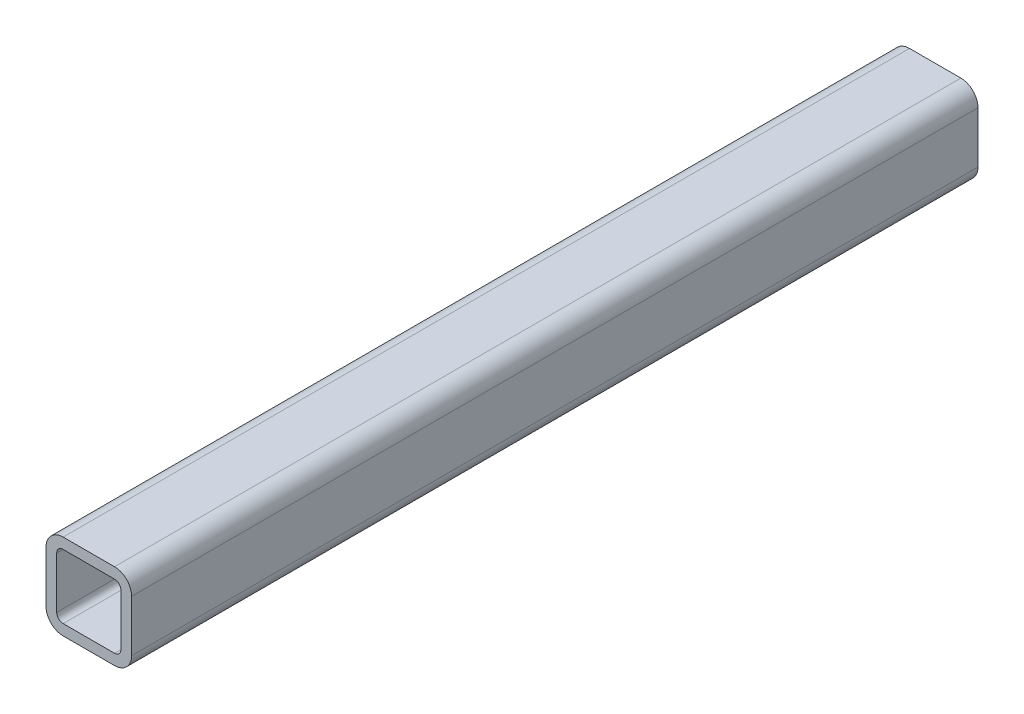
ISO-10303-21;
HEADER;
FILE_DESCRIPTION(('STEP AP214'),'2;1');
FILE_NAME('part.step','',(''),(''),'','','');
FILE_SCHEMA(('AUTOMOTIVE_DESIGN { 1 0 10303 214 1 1 1 1 }'));
ENDSEC;
DATA;
#1=APPLICATION_CONTEXT('core data for automotive mechanical design processes');
#2=APPLICATION_PROTOCOL_DEFINITION('international standard','automotive_design',2000,#1);
#3=PRODUCT_CONTEXT('',#1,'mechanical');
#4=PRODUCT('Part','Part','',(#3));
#5=PRODUCT_RELATED_PRODUCT_CATEGORY('part','',(#4));
#6=PRODUCT_DEFINITION_FORMATION('','',#4);
#7=PRODUCT_DEFINITION_CONTEXT('part definition',#1,'design');
#8=PRODUCT_DEFINITION('design','',#6,#7);
#9=PRODUCT_DEFINITION_SHAPE('','',#8);
#10=(LENGTH_UNIT() NAMED_UNIT(*) SI_UNIT(.MILLI.,.METRE.));
#11=(NAMED_UNIT(*) PLANE_ANGLE_UNIT() SI_UNIT($,.RADIAN.));
#12=(NAMED_UNIT(*) SI_UNIT($,.STERADIAN.) SOLID_ANGLE_UNIT());
#13=UNCERTAINTY_MEASURE_WITH_UNIT(LENGTH_MEASURE(1.E-05),#10,'distance_accuracy_value','');
#14=(GEOMETRIC_REPRESENTATION_CONTEXT(3) GLOBAL_UNCERTAINTY_ASSIGNED_CONTEXT((#13)) GLOBAL_UNIT_ASSIGNED_CONTEXT((#10,
#11,#12)) REPRESENTATION_CONTEXT('',''));
#15=CARTESIAN_POINT('',(0.,0.,0.));
#16=DIRECTION('',(0.,0.,1.));
#17=DIRECTION('',(1.,0.,0.));
#18=AXIS2_PLACEMENT_3D('',#15,#16,#17);
#19=CARTESIAN_POINT('',(7.62000000000002,7.61999999999996,-251.1044));
#20=DIRECTION('',(0.,0.,1.));
#21=DIRECTION('',(1.,0.,0.));
#22=AXIS2_PLACEMENT_3D('',#19,#20,#21);
#23=CYLINDRICAL_SURFACE('',#22,5.08);
#24=CARTESIAN_POINT('',(7.62000000000002,7.61999999999996,0.));
#25=DIRECTION('',(0.,0.,-1.));
#26=DIRECTION('',(-1.,0.,0.));
#27=AXIS2_PLACEMENT_3D('',#24,#25,#26);
#28=CIRCLE('',#27,5.08);
#29=CARTESIAN_POINT('',(7.62000000000002,12.7,0.));
#30=VERTEX_POINT('',#29);
#31=CARTESIAN_POINT('',(12.7,7.61999999999996,0.));
#32=VERTEX_POINT('',#31);
#33=EDGE_CURVE('E239',#30,#32,#28,.T.);
#34=ORIENTED_EDGE('',*,*,#33,.T.);
#35=DIRECTION('',(0.,0.,1.));
#36=VECTOR('',#35,1.);
#37=CARTESIAN_POINT('',(12.7,7.61999999999996,-251.1044));
#38=LINE('',#37,#36);
#39=CARTESIAN_POINT('',(12.7,7.61999999999996,-251.1044));
#40=VERTEX_POINT('',#39);
#41=EDGE_CURVE('E12',#40,#32,#38,.T.);
#42=ORIENTED_EDGE('',*,*,#41,.F.);
#43=CARTESIAN_POINT('',(7.62000000000002,7.61999999999996,-251.1044));
#44=DIRECTION('',(0.,0.,-1.));
#45=DIRECTION('',(-1.,0.,0.));
#46=AXIS2_PLACEMENT_3D('',#43,#44,#45);
#47=CIRCLE('',#46,5.08);
#48=CARTESIAN_POINT('',(7.62000000000002,12.7,-251.1044));
#49=VERTEX_POINT('',#48);
#50=EDGE_CURVE('E317',#49,#40,#47,.T.);
#51=ORIENTED_EDGE('',*,*,#50,.F.);
#52=DIRECTION('',(0.,0.,1.));
#53=VECTOR('',#52,1.);
#54=CARTESIAN_POINT('',(7.62000000000002,12.7,-251.1044));
#55=LINE('',#54,#53);
#56=EDGE_CURVE('E254',#49,#30,#55,.T.);
#57=ORIENTED_EDGE('',*,*,#56,.T.);
#58=EDGE_LOOP('',(#34,#42,#51,#57));
#59=FACE_BOUND('',#58,.T.);
#60=ADVANCED_FACE('F67',(#59),#23,.T.);
#61=CARTESIAN_POINT('',(12.7,7.61999999999996,-251.1044));
#62=DIRECTION('',(-1.,0.,0.));
#63=DIRECTION('',(0.,0.,1.));
#64=AXIS2_PLACEMENT_3D('',#61,#62,#63);
#65=PLANE('',#64);
#66=DIRECTION('',(0.,-1.,0.));
#67=VECTOR('',#66,1.);
#68=CARTESIAN_POINT('',(12.7,7.61999999999996,0.));
#69=LINE('',#68,#67);
#70=CARTESIAN_POINT('',(12.7,-7.61999999999996,0.));
#71=VERTEX_POINT('',#70);
#72=EDGE_CURVE('E242',#32,#71,#69,.T.);
#73=ORIENTED_EDGE('',*,*,#72,.T.);
#74=DIRECTION('',(0.,0.,1.));
#75=VECTOR('',#74,1.);
#76=CARTESIAN_POINT('',(12.7,-7.61999999999996,-251.1044));
#77=LINE('',#76,#75);
#78=CARTESIAN_POINT('',(12.7,-7.61999999999996,-251.1044));
#79=VERTEX_POINT('',#78);
#80=EDGE_CURVE('E77',#79,#71,#77,.T.);
#81=ORIENTED_EDGE('',*,*,#80,.F.);
#82=DIRECTION('',(0.,-1.,0.));
#83=VECTOR('',#82,1.);
#84=CARTESIAN_POINT('',(12.7,7.61999999999996,-251.1044));
#85=LINE('',#84,#83);
#86=EDGE_CURVE('E319',#40,#79,#85,.T.);
#87=ORIENTED_EDGE('',*,*,#86,.F.);
#88=ORIENTED_EDGE('',*,*,#41,.T.);
#89=EDGE_LOOP('',(#73,#81,#87,#88));
#90=FACE_BOUND('',#89,.T.);
#91=ADVANCED_FACE('F354',(#90),#65,.F.);
#92=CARTESIAN_POINT('',(7.62000000000002,-7.61999999999996,-251.1044));
#93=DIRECTION('',(0.,0.,1.));
#94=DIRECTION('',(1.,0.,0.));
#95=AXIS2_PLACEMENT_3D('',#92,#93,#94);
#96=CYLINDRICAL_SURFACE('',#95,5.08);
#97=CARTESIAN_POINT('',(7.62000000000002,-7.61999999999996,0.));
#98=DIRECTION('',(0.,0.,-1.));
#99=DIRECTION('',(-1.,0.,0.));
#100=AXIS2_PLACEMENT_3D('',#97,#98,#99);
#101=CIRCLE('',#100,5.08);
#102=CARTESIAN_POINT('',(7.62000000000002,-12.7,0.));
#103=VERTEX_POINT('',#102);
#104=EDGE_CURVE('E244',#71,#103,#101,.T.);
#105=ORIENTED_EDGE('',*,*,#104,.T.);
#106=DIRECTION('',(0.,0.,1.));
#107=VECTOR('',#106,1.);
#108=CARTESIAN_POINT('',(7.62000000000002,-12.7,-251.1044));
#109=LINE('',#108,#107);
#110=CARTESIAN_POINT('',(7.62000000000002,-12.7,-251.1044));
#111=VERTEX_POINT('',#110);
#112=EDGE_CURVE('E261',#111,#103,#109,.T.);
#113=ORIENTED_EDGE('',*,*,#112,.F.);
#114=CARTESIAN_POINT('',(7.62000000000002,-7.61999999999996,-251.1044));
#115=DIRECTION('',(0.,0.,-1.));
#116=DIRECTION('',(-1.,0.,0.));
#117=AXIS2_PLACEMENT_3D('',#114,#115,#116);
#118=CIRCLE('',#117,5.08);
#119=EDGE_CURVE('E321',#79,#111,#118,.T.);
#120=ORIENTED_EDGE('',*,*,#119,.F.);
#121=ORIENTED_EDGE('',*,*,#80,.T.);
#122=EDGE_LOOP('',(#105,#113,#120,#121));
#123=FACE_BOUND('',#122,.T.);
#124=ADVANCED_FACE('F359',(#123),#96,.T.);
#125=CARTESIAN_POINT('',(-7.62000000000002,-12.7,-251.1044));
#126=DIRECTION('',(0.,1.,0.));
#127=DIRECTION('',(0.,0.,1.));
#128=AXIS2_PLACEMENT_3D('',#125,#126,#127);
#129=PLANE('',#128);
#130=DIRECTION('',(-1.,0.,0.));
#131=VECTOR('',#130,1.);
#132=CARTESIAN_POINT('',(-7.62000000000002,-12.7,0.));
#133=LINE('',#132,#131);
#134=CARTESIAN_POINT('',(-7.62000000000002,-12.7,0.));
#135=VERTEX_POINT('',#134);
#136=EDGE_CURVE('E246',#103,#135,#133,.T.);
#137=ORIENTED_EDGE('',*,*,#136,.T.);
#138=DIRECTION('',(0.,0.,1.));
#139=VECTOR('',#138,1.);
#140=CARTESIAN_POINT('',(-7.62000000000002,-12.7,-251.1044));
#141=LINE('',#140,#139);
#142=CARTESIAN_POINT('',(-7.62000000000002,-12.7,-251.1044));
#143=VERTEX_POINT('',#142);
#144=EDGE_CURVE('E258',#143,#135,#141,.T.);
#145=ORIENTED_EDGE('',*,*,#144,.F.);
#146=DIRECTION('',(-1.,0.,0.));
#147=VECTOR('',#146,1.);
#148=CARTESIAN_POINT('',(-7.62000000000002,-12.7,-251.1044));
#149=LINE('',#148,#147);
#150=EDGE_CURVE('E323',#111,#143,#149,.T.);
#151=ORIENTED_EDGE('',*,*,#150,.F.);
#152=ORIENTED_EDGE('',*,*,#112,.T.);
#153=EDGE_LOOP('',(#137,#145,#151,#152));
#154=FACE_BOUND('',#153,.T.);
#155=ADVANCED_FACE('F329',(#154),#129,.F.);
#156=CARTESIAN_POINT('',(-7.62000000000002,-7.61999999999996,-251.1044));
#157=DIRECTION('',(0.,0.,1.));
#158=DIRECTION('',(1.,0.,0.));
#159=AXIS2_PLACEMENT_3D('',#156,#157,#158);
#160=CYLINDRICAL_SURFACE('',#159,5.08);
#161=CARTESIAN_POINT('',(-7.62000000000002,-7.61999999999996,0.));
#162=DIRECTION('',(0.,0.,-1.));
#163=DIRECTION('',(-1.,0.,0.));
#164=AXIS2_PLACEMENT_3D('',#161,#162,#163);
#165=CIRCLE('',#164,5.08);
#166=CARTESIAN_POINT('',(-12.7,-7.61999999999996,0.));
#167=VERTEX_POINT('',#166);
#168=EDGE_CURVE('E248',#135,#167,#165,.T.);
#169=ORIENTED_EDGE('',*,*,#168,.T.);
#170=DIRECTION('',(0.,0.,1.));
#171=VECTOR('',#170,1.);
#172=CARTESIAN_POINT('',(-12.7,-7.61999999999996,-251.1044));
#173=LINE('',#172,#171);
#174=CARTESIAN_POINT('',(-12.7,-7.61999999999996,-251.1044));
#175=VERTEX_POINT('',#174);
#176=EDGE_CURVE('E206',#175,#167,#173,.T.);
#177=ORIENTED_EDGE('',*,*,#176,.F.);
#178=CARTESIAN_POINT('',(-7.62000000000002,-7.61999999999996,-251.1044));
#179=DIRECTION('',(0.,0.,-1.));
#180=DIRECTION('',(-1.,0.,0.));
#181=AXIS2_PLACEMENT_3D('',#178,#179,#180);
#182=CIRCLE('',#181,5.08);
#183=EDGE_CURVE('E197',#143,#175,#182,.T.);
#184=ORIENTED_EDGE('',*,*,#183,.F.);
#185=ORIENTED_EDGE('',*,*,#144,.T.);
#186=EDGE_LOOP('',(#169,#177,#184,#185));
#187=FACE_BOUND('',#186,.T.);
#188=ADVANCED_FACE('F333',(#187),#160,.T.);
#189=CARTESIAN_POINT('',(-12.7,-7.61999999999996,-251.1044));
#190=DIRECTION('',(1.,0.,0.));
#191=DIRECTION('',(0.,0.,-1.));
#192=AXIS2_PLACEMENT_3D('',#189,#190,#191);
#193=PLANE('',#192);
#194=DIRECTION('',(0.,1.,0.));
#195=VECTOR('',#194,1.);
#196=CARTESIAN_POINT('',(-12.7,-7.61999999999996,0.));
#197=LINE('',#196,#195);
#198=CARTESIAN_POINT('',(-12.7,7.61999999999996,0.));
#199=VERTEX_POINT('',#198);
#200=EDGE_CURVE('E205',#167,#199,#197,.T.);
#201=ORIENTED_EDGE('',*,*,#200,.T.);
#202=DIRECTION('',(0.,0.,1.));
#203=VECTOR('',#202,1.);
#204=CARTESIAN_POINT('',(-12.7,7.61999999999996,-251.1044));
#205=LINE('',#204,#203);
#206=CARTESIAN_POINT('',(-12.7,7.61999999999996,-251.1044));
#207=VERTEX_POINT('',#206);
#208=EDGE_CURVE('E202',#207,#199,#205,.T.);
#209=ORIENTED_EDGE('',*,*,#208,.F.);
#210=DIRECTION('',(0.,1.,0.));
#211=VECTOR('',#210,1.);
#212=CARTESIAN_POINT('',(-12.7,-7.61999999999996,-251.1044));
#213=LINE('',#212,#211);
#214=EDGE_CURVE('E191',#175,#207,#213,.T.);
#215=ORIENTED_EDGE('',*,*,#214,.F.);
#216=ORIENTED_EDGE('',*,*,#176,.T.);
#217=EDGE_LOOP('',(#201,#209,#215,#216));
#218=FACE_BOUND('',#217,.T.);
#219=ADVANCED_FACE('F203',(#218),#193,.F.);
#220=CARTESIAN_POINT('',(-7.62000000000002,7.61999999999996,-251.1044));
#221=DIRECTION('',(0.,0.,1.));
#222=DIRECTION('',(1.,0.,0.));
#223=AXIS2_PLACEMENT_3D('',#220,#221,#222);
#224=CYLINDRICAL_SURFACE('',#223,5.08);
#225=CARTESIAN_POINT('',(-7.62000000000002,7.61999999999996,0.));
#226=DIRECTION('',(0.,0.,-1.));
#227=DIRECTION('',(-1.,0.,0.));
#228=AXIS2_PLACEMENT_3D('',#225,#226,#227);
#229=CIRCLE('',#228,5.08);
#230=CARTESIAN_POINT('',(-7.62000000000002,12.7,0.));
#231=VERTEX_POINT('',#230);
#232=EDGE_CURVE('E139',#199,#231,#229,.T.);
#233=ORIENTED_EDGE('',*,*,#232,.T.);
#234=DIRECTION('',(0.,0.,1.));
#235=VECTOR('',#234,1.);
#236=CARTESIAN_POINT('',(-7.62000000000002,12.7,-251.1044));
#237=LINE('',#236,#235);
#238=CARTESIAN_POINT('',(-7.62000000000002,12.7,-251.1044));
#239=VERTEX_POINT('',#238);
#240=EDGE_CURVE('E207',#239,#231,#237,.T.);
#241=ORIENTED_EDGE('',*,*,#240,.F.);
#242=CARTESIAN_POINT('',(-7.62000000000002,7.61999999999996,-251.1044));
#243=DIRECTION('',(0.,0.,-1.));
#244=DIRECTION('',(-1.,0.,0.));
#245=AXIS2_PLACEMENT_3D('',#242,#243,#244);
#246=CIRCLE('',#245,5.08);
#247=EDGE_CURVE('E195',#207,#239,#246,.T.);
#248=ORIENTED_EDGE('',*,*,#247,.F.);
#249=ORIENTED_EDGE('',*,*,#208,.T.);
#250=EDGE_LOOP('',(#233,#241,#248,#249));
#251=FACE_BOUND('',#250,.T.);
#252=ADVANCED_FACE('F209',(#251),#224,.T.);
#253=CARTESIAN_POINT('',(7.62000000000002,-7.61999999999996,-251.1044));
#254=DIRECTION('',(0.,0.,1.));
#255=DIRECTION('',(1.,0.,0.));
#256=AXIS2_PLACEMENT_3D('',#253,#254,#255);
#257=CYLINDRICAL_SURFACE('',#256,1.905);
#258=CARTESIAN_POINT('',(7.62000000000002,-7.61999999999996,0.));
#259=DIRECTION('',(0.,0.,-1.));
#260=DIRECTION('',(-1.,0.,0.));
#261=AXIS2_PLACEMENT_3D('',#258,#259,#260);
#262=CIRCLE('',#261,1.905);
#263=CARTESIAN_POINT('',(9.52500000000001,-7.61999999999996,0.));
#264=VERTEX_POINT('',#263);
#265=CARTESIAN_POINT('',(7.62000000000002,-9.52500000000001,0.));
#266=VERTEX_POINT('',#265);
#267=EDGE_CURVE('E215',#264,#266,#262,.T.);
#268=ORIENTED_EDGE('',*,*,#267,.F.);
#269=DIRECTION('',(0.,0.,1.));
#270=VECTOR('',#269,1.);
#271=CARTESIAN_POINT('',(9.52500000000001,-7.61999999999996,-251.1044));
#272=LINE('',#271,#270);
#273=CARTESIAN_POINT('',(9.52500000000001,-7.61999999999996,-251.1044));
#274=VERTEX_POINT('',#273);
#275=EDGE_CURVE('E71',#274,#264,#272,.T.);
#276=ORIENTED_EDGE('',*,*,#275,.F.);
#277=CARTESIAN_POINT('',(7.62000000000002,-7.61999999999996,-251.1044));
#278=DIRECTION('',(0.,0.,-1.));
#279=DIRECTION('',(-1.,0.,0.));
#280=AXIS2_PLACEMENT_3D('',#277,#278,#279);
#281=CIRCLE('',#280,1.905);
#282=CARTESIAN_POINT('',(7.62000000000002,-9.52500000000001,-251.1044));
#283=VERTEX_POINT('',#282);
#284=EDGE_CURVE('E253',#274,#283,#281,.T.);
#285=ORIENTED_EDGE('',*,*,#284,.T.);
#286=DIRECTION('',(0.,0.,1.));
#287=VECTOR('',#286,1.);
#288=CARTESIAN_POINT('',(7.62000000000002,-9.52500000000001,-251.1044));
#289=LINE('',#288,#287);
#290=EDGE_CURVE('E211',#283,#266,#289,.T.);
#291=ORIENTED_EDGE('',*,*,#290,.T.);
#292=EDGE_LOOP('',(#268,#276,#285,#291));
#293=FACE_BOUND('',#292,.T.);
#294=ADVANCED_FACE('F69',(#293),#257,.F.);
#295=CARTESIAN_POINT('',(9.52500000000001,7.61999999999996,-251.1044));
#296=DIRECTION('',(-1.,0.,0.));
#297=DIRECTION('',(0.,0.,1.));
#298=AXIS2_PLACEMENT_3D('',#295,#296,#297);
#299=PLANE('',#298);
#300=DIRECTION('',(0.,-1.,0.));
#301=VECTOR('',#300,1.);
#302=CARTESIAN_POINT('',(9.52500000000001,7.61999999999996,0.));
#303=LINE('',#302,#301);
#304=CARTESIAN_POINT('',(9.52500000000001,7.61999999999996,0.));
#305=VERTEX_POINT('',#304);
#306=EDGE_CURVE('E218',#305,#264,#303,.T.);
#307=ORIENTED_EDGE('',*,*,#306,.F.);
#308=DIRECTION('',(0.,0.,1.));
#309=VECTOR('',#308,1.);
#310=CARTESIAN_POINT('',(9.52500000000001,7.61999999999996,-251.1044));
#311=LINE('',#310,#309);
#312=CARTESIAN_POINT('',(9.52500000000001,7.61999999999996,-251.1044));
#313=VERTEX_POINT('',#312);
#314=EDGE_CURVE('E276',#313,#305,#311,.T.);
#315=ORIENTED_EDGE('',*,*,#314,.F.);
#316=DIRECTION('',(0.,-1.,0.));
#317=VECTOR('',#316,1.);
#318=CARTESIAN_POINT('',(9.52500000000001,7.61999999999996,-251.1044));
#319=LINE('',#318,#317);
#320=EDGE_CURVE('E285',#313,#274,#319,.T.);
#321=ORIENTED_EDGE('',*,*,#320,.T.);
#322=ORIENTED_EDGE('',*,*,#275,.T.);
#323=EDGE_LOOP('',(#307,#315,#321,#322));
#324=FACE_BOUND('',#323,.T.);
#325=ADVANCED_FACE('F283',(#324),#299,.T.);
#326=CARTESIAN_POINT('',(7.62000000000002,7.61999999999996,-251.1044));
#327=DIRECTION('',(0.,0.,1.));
#328=DIRECTION('',(1.,0.,0.));
#329=AXIS2_PLACEMENT_3D('',#326,#327,#328);
#330=CYLINDRICAL_SURFACE('',#329,1.905);
#331=CARTESIAN_POINT('',(7.62000000000002,7.61999999999996,0.));
#332=DIRECTION('',(0.,0.,-1.));
#333=DIRECTION('',(-1.,0.,0.));
#334=AXIS2_PLACEMENT_3D('',#331,#332,#333);
#335=CIRCLE('',#334,1.905);
#336=CARTESIAN_POINT('',(7.62000000000002,9.52500000000001,0.));
#337=VERTEX_POINT('',#336);
#338=EDGE_CURVE('E221',#337,#305,#335,.T.);
#339=ORIENTED_EDGE('',*,*,#338,.F.);
#340=DIRECTION('',(0.,0.,1.));
#341=VECTOR('',#340,1.);
#342=CARTESIAN_POINT('',(7.62000000000002,9.52500000000001,-251.1044));
#343=LINE('',#342,#341);
#344=CARTESIAN_POINT('',(7.62000000000002,9.52500000000001,-251.1044));
#345=VERTEX_POINT('',#344);
#346=EDGE_CURVE('E275',#345,#337,#343,.T.);
#347=ORIENTED_EDGE('',*,*,#346,.F.);
#348=CARTESIAN_POINT('',(7.62000000000002,7.61999999999996,-251.1044));
#349=DIRECTION('',(0.,0.,-1.));
#350=DIRECTION('',(-1.,0.,0.));
#351=AXIS2_PLACEMENT_3D('',#348,#349,#350);
#352=CIRCLE('',#351,1.905);
#353=EDGE_CURVE('E293',#345,#313,#352,.T.);
#354=ORIENTED_EDGE('',*,*,#353,.T.);
#355=ORIENTED_EDGE('',*,*,#314,.T.);
#356=EDGE_LOOP('',(#339,#347,#354,#355));
#357=FACE_BOUND('',#356,.T.);
#358=ADVANCED_FACE('F291',(#357),#330,.F.);
#359=CARTESIAN_POINT('',(7.62000000000002,9.52500000000001,-251.1044));
#360=DIRECTION('',(0.,-1.,0.));
#361=DIRECTION('',(0.,0.,-1.));
#362=AXIS2_PLACEMENT_3D('',#359,#360,#361);
#363=PLANE('',#362);
#364=DIRECTION('',(1.,0.,0.));
#365=VECTOR('',#364,1.);
#366=CARTESIAN_POINT('',(7.62000000000002,9.52500000000001,0.));
#367=LINE('',#366,#365);
#368=CARTESIAN_POINT('',(-7.62000000000002,9.52500000000001,0.));
#369=VERTEX_POINT('',#368);
#370=EDGE_CURVE('E224',#369,#337,#367,.T.);
#371=ORIENTED_EDGE('',*,*,#370,.F.);
#372=DIRECTION('',(0.,0.,1.));
#373=VECTOR('',#372,1.);
#374=CARTESIAN_POINT('',(-7.62000000000002,9.52500000000001,-251.1044));
#375=LINE('',#374,#373);
#376=CARTESIAN_POINT('',(-7.62000000000002,9.52500000000001,-251.1044));
#377=VERTEX_POINT('',#376);
#378=EDGE_CURVE('E273',#377,#369,#375,.T.);
#379=ORIENTED_EDGE('',*,*,#378,.F.);
#380=DIRECTION('',(1.,0.,0.));
#381=VECTOR('',#380,1.);
#382=CARTESIAN_POINT('',(7.62000000000002,9.52500000000001,-251.1044));
#383=LINE('',#382,#381);
#384=EDGE_CURVE('E299',#377,#345,#383,.T.);
#385=ORIENTED_EDGE('',*,*,#384,.T.);
#386=ORIENTED_EDGE('',*,*,#346,.T.);
#387=EDGE_LOOP('',(#371,#379,#385,#386));
#388=FACE_BOUND('',#387,.T.);
#389=ADVANCED_FACE('F302',(#388),#363,.T.);
#390=CARTESIAN_POINT('',(-7.62000000000002,7.61999999999996,-251.1044));
#391=DIRECTION('',(0.,0.,1.));
#392=DIRECTION('',(1.,0.,0.));
#393=AXIS2_PLACEMENT_3D('',#390,#391,#392);
#394=CYLINDRICAL_SURFACE('',#393,1.905);
#395=CARTESIAN_POINT('',(-7.62000000000002,7.61999999999996,0.));
#396=DIRECTION('',(0.,0.,-1.));
#397=DIRECTION('',(-1.,0.,0.));
#398=AXIS2_PLACEMENT_3D('',#395,#396,#397);
#399=CIRCLE('',#398,1.905);
#400=CARTESIAN_POINT('',(-9.52500000000001,7.61999999999996,0.));
#401=VERTEX_POINT('',#400);
#402=EDGE_CURVE('E227',#401,#369,#399,.T.);
#403=ORIENTED_EDGE('',*,*,#402,.F.);
#404=DIRECTION('',(0.,0.,1.));
#405=VECTOR('',#404,1.);
#406=CARTESIAN_POINT('',(-9.52500000000001,7.61999999999996,-251.1044));
#407=LINE('',#406,#405);
#408=CARTESIAN_POINT('',(-9.52500000000001,7.61999999999996,-251.1044));
#409=VERTEX_POINT('',#408);
#410=EDGE_CURVE('E271',#409,#401,#407,.T.);
#411=ORIENTED_EDGE('',*,*,#410,.F.);
#412=CARTESIAN_POINT('',(-7.62000000000002,7.61999999999996,-251.1044));
#413=DIRECTION('',(0.,0.,-1.));
#414=DIRECTION('',(-1.,0.,0.));
#415=AXIS2_PLACEMENT_3D('',#412,#413,#414);
#416=CIRCLE('',#415,1.905);
#417=EDGE_CURVE('E303',#409,#377,#416,.T.);
#418=ORIENTED_EDGE('',*,*,#417,.T.);
#419=ORIENTED_EDGE('',*,*,#378,.T.);
#420=EDGE_LOOP('',(#403,#411,#418,#419));
#421=FACE_BOUND('',#420,.T.);
#422=ADVANCED_FACE('F370',(#421),#394,.F.);
#423=CARTESIAN_POINT('',(-9.52500000000001,-7.61999999999996,-251.1044));
#424=DIRECTION('',(1.,0.,0.));
#425=DIRECTION('',(0.,0.,-1.));
#426=AXIS2_PLACEMENT_3D('',#423,#424,#425);
#427=PLANE('',#426);
#428=DIRECTION('',(0.,1.,0.));
#429=VECTOR('',#428,1.);
#430=CARTESIAN_POINT('',(-9.52500000000001,-7.61999999999996,0.));
#431=LINE('',#430,#429);
#432=CARTESIAN_POINT('',(-9.52500000000001,-7.61999999999996,0.));
#433=VERTEX_POINT('',#432);
#434=EDGE_CURVE('E230',#433,#401,#431,.T.);
#435=ORIENTED_EDGE('',*,*,#434,.F.);
#436=DIRECTION('',(0.,0.,1.));
#437=VECTOR('',#436,1.);
#438=CARTESIAN_POINT('',(-9.52500000000001,-7.61999999999996,-251.1044));
#439=LINE('',#438,#437);
#440=CARTESIAN_POINT('',(-9.52500000000001,-7.61999999999996,-251.1044));
#441=VERTEX_POINT('',#440);
#442=EDGE_CURVE('E269',#441,#433,#439,.T.);
#443=ORIENTED_EDGE('',*,*,#442,.F.);
#444=DIRECTION('',(0.,1.,0.));
#445=VECTOR('',#444,1.);
#446=CARTESIAN_POINT('',(-9.52500000000001,-7.61999999999996,-251.1044));
#447=LINE('',#446,#445);
#448=EDGE_CURVE('E305',#441,#409,#447,.T.);
#449=ORIENTED_EDGE('',*,*,#448,.T.);
#450=ORIENTED_EDGE('',*,*,#410,.T.);
#451=EDGE_LOOP('',(#435,#443,#449,#450));
#452=FACE_BOUND('',#451,.T.);
#453=ADVANCED_FACE('F366',(#452),#427,.T.);
#454=CARTESIAN_POINT('',(-7.62000000000002,-7.61999999999996,-251.1044));
#455=DIRECTION('',(0.,0.,1.));
#456=DIRECTION('',(1.,0.,0.));
#457=AXIS2_PLACEMENT_3D('',#454,#455,#456);
#458=CYLINDRICAL_SURFACE('',#457,1.905);
#459=CARTESIAN_POINT('',(-7.62000000000002,-7.61999999999996,0.));
#460=DIRECTION('',(0.,0.,-1.));
#461=DIRECTION('',(-1.,0.,0.));
#462=AXIS2_PLACEMENT_3D('',#459,#460,#461);
#463=CIRCLE('',#462,1.905);
#464=CARTESIAN_POINT('',(-7.62000000000002,-9.52500000000001,0.));
#465=VERTEX_POINT('',#464);
#466=EDGE_CURVE('E233',#465,#433,#463,.T.);
#467=ORIENTED_EDGE('',*,*,#466,.F.);
#468=DIRECTION('',(0.,0.,1.));
#469=VECTOR('',#468,1.);
#470=CARTESIAN_POINT('',(-7.62000000000002,-9.52500000000001,-251.1044));
#471=LINE('',#470,#469);
#472=CARTESIAN_POINT('',(-7.62000000000002,-9.52500000000001,-251.1044));
#473=VERTEX_POINT('',#472);
#474=EDGE_CURVE('E267',#473,#465,#471,.T.);
#475=ORIENTED_EDGE('',*,*,#474,.F.);
#476=CARTESIAN_POINT('',(-7.62000000000002,-7.61999999999996,-251.1044));
#477=DIRECTION('',(0.,0.,-1.));
#478=DIRECTION('',(-1.,0.,0.));
#479=AXIS2_PLACEMENT_3D('',#476,#477,#478);
#480=CIRCLE('',#479,1.905);
#481=EDGE_CURVE('E311',#473,#441,#480,.T.);
#482=ORIENTED_EDGE('',*,*,#481,.T.);
#483=ORIENTED_EDGE('',*,*,#442,.T.);
#484=EDGE_LOOP('',(#467,#475,#482,#483));
#485=FACE_BOUND('',#484,.T.);
#486=ADVANCED_FACE('F348',(#485),#458,.F.);
#487=CARTESIAN_POINT('',(-7.62000000000002,-9.52500000000001,-251.1044));
#488=DIRECTION('',(0.,1.,0.));
#489=DIRECTION('',(0.,0.,1.));
#490=AXIS2_PLACEMENT_3D('',#487,#488,#489);
#491=PLANE('',#490);
#492=DIRECTION('',(-1.,0.,0.));
#493=VECTOR('',#492,1.);
#494=CARTESIAN_POINT('',(-7.62000000000002,-9.52500000000001,0.));
#495=LINE('',#494,#493);
#496=EDGE_CURVE('E236',#266,#465,#495,.T.);
#497=ORIENTED_EDGE('',*,*,#496,.F.);
#498=ORIENTED_EDGE('',*,*,#290,.F.);
#499=DIRECTION('',(-1.,0.,0.));
#500=VECTOR('',#499,1.);
#501=CARTESIAN_POINT('',(-7.62000000000002,-9.52500000000001,-251.1044));
#502=LINE('',#501,#500);
#503=EDGE_CURVE('E314',#283,#473,#502,.T.);
#504=ORIENTED_EDGE('',*,*,#503,.T.);
#505=ORIENTED_EDGE('',*,*,#474,.T.);
#506=EDGE_LOOP('',(#497,#498,#504,#505));
#507=FACE_BOUND('',#506,.T.);
#508=ADVANCED_FACE('F341',(#507),#491,.T.);
#509=CARTESIAN_POINT('',(7.62000000000002,12.7,-251.1044));
#510=DIRECTION('',(0.,-1.,0.));
#511=DIRECTION('',(0.,0.,-1.));
#512=AXIS2_PLACEMENT_3D('',#509,#510,#511);
#513=PLANE('',#512);
#514=DIRECTION('',(1.,0.,0.));
#515=VECTOR('',#514,1.);
#516=CARTESIAN_POINT('',(7.62000000000002,12.7,0.));
#517=LINE('',#516,#515);
#518=EDGE_CURVE('E145',#231,#30,#517,.T.);
#519=ORIENTED_EDGE('',*,*,#518,.T.);
#520=ORIENTED_EDGE('',*,*,#56,.F.);
#521=DIRECTION('',(1.,0.,0.));
#522=VECTOR('',#521,1.);
#523=CARTESIAN_POINT('',(7.62000000000002,12.7,-251.1044));
#524=LINE('',#523,#522);
#525=EDGE_CURVE('E86',#239,#49,#524,.T.);
#526=ORIENTED_EDGE('',*,*,#525,.F.);
#527=ORIENTED_EDGE('',*,*,#240,.T.);
#528=EDGE_LOOP('',(#519,#520,#526,#527));
#529=FACE_BOUND('',#528,.T.);
#530=ADVANCED_FACE('F339',(#529),#513,.F.);
#531=CARTESIAN_POINT('',(7.62000000000002,7.61999999999996,-251.1044));
#532=DIRECTION('',(0.,0.,-1.));
#533=DIRECTION('',(-1.,0.,0.));
#534=AXIS2_PLACEMENT_3D('',#531,#532,#533);
#535=PLANE('',#534);
#536=ORIENTED_EDGE('',*,*,#284,.F.);
#537=ORIENTED_EDGE('',*,*,#320,.F.);
#538=ORIENTED_EDGE('',*,*,#353,.F.);
#539=ORIENTED_EDGE('',*,*,#384,.F.);
#540=ORIENTED_EDGE('',*,*,#417,.F.);
#541=ORIENTED_EDGE('',*,*,#448,.F.);
#542=ORIENTED_EDGE('',*,*,#481,.F.);
#543=ORIENTED_EDGE('',*,*,#503,.F.);
#544=EDGE_LOOP('',(#536,#537,#538,#539,#540,#541,#542,#543));
#545=FACE_BOUND('',#544,.T.);
#546=ORIENTED_EDGE('',*,*,#50,.T.);
#547=ORIENTED_EDGE('',*,*,#86,.T.);
#548=ORIENTED_EDGE('',*,*,#119,.T.);
#549=ORIENTED_EDGE('',*,*,#150,.T.);
#550=ORIENTED_EDGE('',*,*,#183,.T.);
#551=ORIENTED_EDGE('',*,*,#214,.T.);
#552=ORIENTED_EDGE('',*,*,#247,.T.);
#553=ORIENTED_EDGE('',*,*,#525,.T.);
#554=EDGE_LOOP('',(#546,#547,#548,#549,#550,#551,#552,#553));
#555=FACE_BOUND('',#554,.T.);
#556=ADVANCED_FACE('F193',(#545,#555),#535,.T.);
#557=CARTESIAN_POINT('',(7.62000000000002,7.61999999999996,0.));
#558=DIRECTION('',(0.,0.,-1.));
#559=DIRECTION('',(-1.,0.,0.));
#560=AXIS2_PLACEMENT_3D('',#557,#558,#559);
#561=PLANE('',#560);
#562=ORIENTED_EDGE('',*,*,#267,.T.);
#563=ORIENTED_EDGE('',*,*,#496,.T.);
#564=ORIENTED_EDGE('',*,*,#466,.T.);
#565=ORIENTED_EDGE('',*,*,#434,.T.);
#566=ORIENTED_EDGE('',*,*,#402,.T.);
#567=ORIENTED_EDGE('',*,*,#370,.T.);
#568=ORIENTED_EDGE('',*,*,#338,.T.);
#569=ORIENTED_EDGE('',*,*,#306,.T.);
#570=EDGE_LOOP('',(#562,#563,#564,#565,#566,#567,#568,#569));
#571=FACE_BOUND('',#570,.T.);
#572=ORIENTED_EDGE('',*,*,#33,.F.);
#573=ORIENTED_EDGE('',*,*,#518,.F.);
#574=ORIENTED_EDGE('',*,*,#232,.F.);
#575=ORIENTED_EDGE('',*,*,#200,.F.);
#576=ORIENTED_EDGE('',*,*,#168,.F.);
#577=ORIENTED_EDGE('',*,*,#136,.F.);
#578=ORIENTED_EDGE('',*,*,#104,.F.);
#579=ORIENTED_EDGE('',*,*,#72,.F.);
#580=EDGE_LOOP('',(#572,#573,#574,#575,#576,#577,#578,#579));
#581=FACE_BOUND('',#580,.T.);
#582=ADVANCED_FACE('F288',(#571,#581),#561,.F.);
#583=CLOSED_SHELL('',(#60,#91,#124,#155,#188,#219,#252,#294,#325,#358,#389,#422,#453,#486,#508,
#530,#556,#582));
#584=MANIFOLD_SOLID_BREP('B2',#583);
#585=ADVANCED_BREP_SHAPE_REPRESENTATION('',(#18,#584),#14);
#586=SHAPE_DEFINITION_REPRESENTATION(#9,#585);
ENDSEC;
END-ISO-10303-21;
